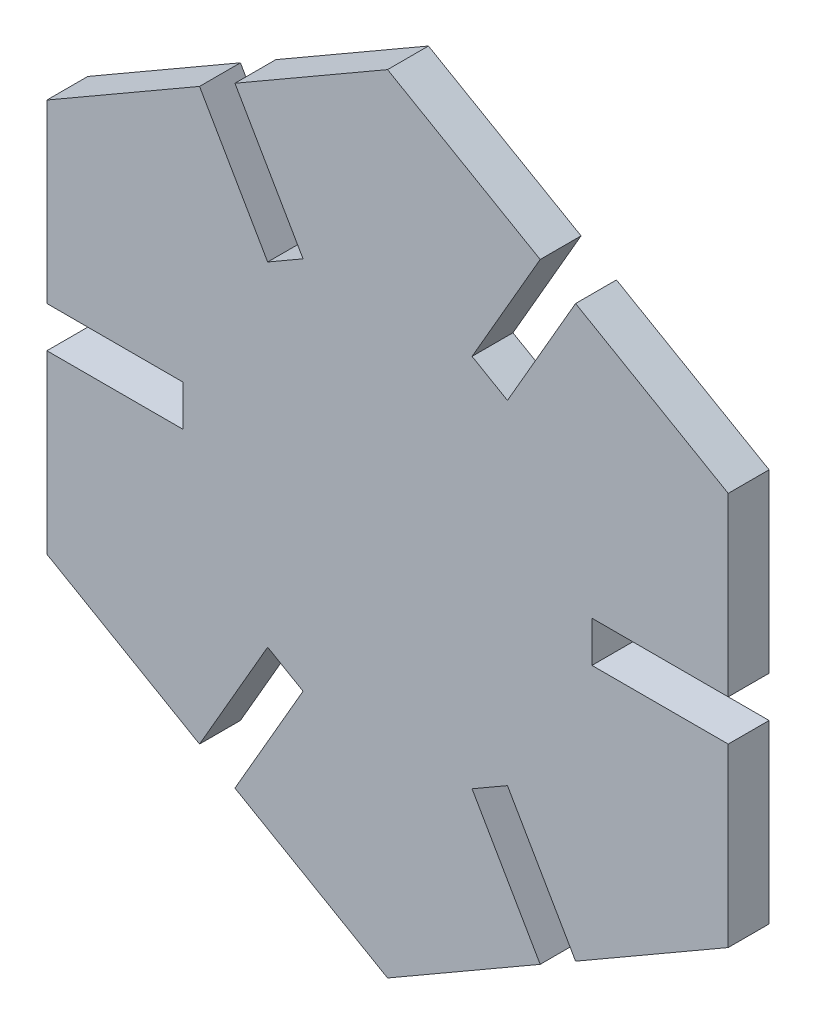
ISO-10303-21;
HEADER;
FILE_DESCRIPTION(('STEP AP214'),'2;1');
FILE_NAME('part.step','',(''),(''),'','','');
FILE_SCHEMA(('AUTOMOTIVE_DESIGN { 1 0 10303 214 1 1 1 1 }'));
ENDSEC;
DATA;
#1=APPLICATION_CONTEXT('core data for automotive mechanical design processes');
#2=APPLICATION_PROTOCOL_DEFINITION('international standard','automotive_design',2000,#1);
#3=PRODUCT_CONTEXT('',#1,'mechanical');
#4=PRODUCT('Part','Part','',(#3));
#5=PRODUCT_RELATED_PRODUCT_CATEGORY('part','',(#4));
#6=PRODUCT_DEFINITION_FORMATION('','',#4);
#7=PRODUCT_DEFINITION_CONTEXT('part definition',#1,'design');
#8=PRODUCT_DEFINITION('design','',#6,#7);
#9=PRODUCT_DEFINITION_SHAPE('','',#8);
#10=(LENGTH_UNIT() NAMED_UNIT(*) SI_UNIT(.MILLI.,.METRE.));
#11=(NAMED_UNIT(*) PLANE_ANGLE_UNIT() SI_UNIT($,.RADIAN.));
#12=(NAMED_UNIT(*) SI_UNIT($,.STERADIAN.) SOLID_ANGLE_UNIT());
#13=UNCERTAINTY_MEASURE_WITH_UNIT(LENGTH_MEASURE(1.E-05),#10,'distance_accuracy_value','');
#14=(GEOMETRIC_REPRESENTATION_CONTEXT(3) GLOBAL_UNCERTAINTY_ASSIGNED_CONTEXT((#13)) GLOBAL_UNIT_ASSIGNED_CONTEXT((#10,
#11,#12)) REPRESENTATION_CONTEXT('',''));
#15=CARTESIAN_POINT('',(0.,0.,0.));
#16=DIRECTION('',(0.,0.,1.));
#17=DIRECTION('',(1.,0.,0.));
#18=AXIS2_PLACEMENT_3D('',#15,#16,#17);
#19=CARTESIAN_POINT('',(-13.7990381056767,20.900635094611,3.));
#20=DIRECTION('',(0.866025403784439,0.5,0.));
#21=DIRECTION('',(-0.5,0.866025403784439,0.));
#22=AXIS2_PLACEMENT_3D('',#19,#20,#21);
#23=PLANE('',#22);
#24=DIRECTION('',(0.5,-0.866025403784439,0.));
#25=VECTOR('',#24,1.);
#26=CARTESIAN_POINT('',(-13.7990381056767,20.900635094611,0.));
#27=LINE('',#26,#25);
#28=CARTESIAN_POINT('',(-13.7990381056767,20.900635094611,0.));
#29=VERTEX_POINT('',#28);
#30=CARTESIAN_POINT('',(-8.79903810567667,12.2403810567666,0.));
#31=VERTEX_POINT('',#30);
#32=EDGE_CURVE('E263',#29,#31,#27,.T.);
#33=ORIENTED_EDGE('',*,*,#32,.F.);
#34=DIRECTION('',(0.,0.,-1.));
#35=VECTOR('',#34,1.);
#36=CARTESIAN_POINT('',(-13.7990381056767,20.900635094611,3.));
#37=LINE('',#36,#35);
#38=CARTESIAN_POINT('',(-13.7990381056767,20.900635094611,3.));
#39=VERTEX_POINT('',#38);
#40=EDGE_CURVE('E11',#39,#29,#37,.T.);
#41=ORIENTED_EDGE('',*,*,#40,.F.);
#42=DIRECTION('',(0.5,-0.866025403784439,0.));
#43=VECTOR('',#42,1.);
#44=CARTESIAN_POINT('',(-13.7990381056767,20.900635094611,3.));
#45=LINE('',#44,#43);
#46=CARTESIAN_POINT('',(-8.79903810567667,12.2403810567666,3.));
#47=VERTEX_POINT('',#46);
#48=EDGE_CURVE('E332',#39,#47,#45,.T.);
#49=ORIENTED_EDGE('',*,*,#48,.T.);
#50=DIRECTION('',(0.,0.,-1.));
#51=VECTOR('',#50,1.);
#52=CARTESIAN_POINT('',(-8.79903810567667,12.2403810567666,3.));
#53=LINE('',#52,#51);
#54=EDGE_CURVE('E36',#47,#31,#53,.T.);
#55=ORIENTED_EDGE('',*,*,#54,.T.);
#56=EDGE_LOOP('',(#33,#41,#49,#55));
#57=FACE_BOUND('',#56,.T.);
#58=ADVANCED_FACE('F33',(#57),#23,.T.);
#59=CARTESIAN_POINT('',(-13.7990381056767,20.900635094611,3.));
#60=DIRECTION('',(0.499999999999998,-0.86602540378444,0.));
#61=DIRECTION('',(0.86602540378444,0.499999999999998,0.));
#62=AXIS2_PLACEMENT_3D('',#59,#60,#61);
#63=PLANE('',#62);
#64=DIRECTION('',(-0.86602540378444,-0.499999999999998,0.));
#65=VECTOR('',#64,1.);
#66=CARTESIAN_POINT('',(-13.7990381056767,20.900635094611,0.));
#67=LINE('',#66,#65);
#68=CARTESIAN_POINT('',(-25.,14.4337567297407,0.));
#69=VERTEX_POINT('',#68);
#70=EDGE_CURVE('E144',#29,#69,#67,.T.);
#71=ORIENTED_EDGE('',*,*,#70,.T.);
#72=DIRECTION('',(0.,0.,-1.));
#73=VECTOR('',#72,1.);
#74=CARTESIAN_POINT('',(-25.,14.4337567297407,3.));
#75=LINE('',#74,#73);
#76=CARTESIAN_POINT('',(-25.,14.4337567297407,3.));
#77=VERTEX_POINT('',#76);
#78=EDGE_CURVE('E42',#77,#69,#75,.T.);
#79=ORIENTED_EDGE('',*,*,#78,.F.);
#80=DIRECTION('',(-0.86602540378444,-0.499999999999998,0.));
#81=VECTOR('',#80,1.);
#82=CARTESIAN_POINT('',(-13.7990381056767,20.900635094611,3.));
#83=LINE('',#82,#81);
#84=EDGE_CURVE('E241',#39,#77,#83,.T.);
#85=ORIENTED_EDGE('',*,*,#84,.F.);
#86=ORIENTED_EDGE('',*,*,#40,.T.);
#87=EDGE_LOOP('',(#71,#79,#85,#86));
#88=FACE_BOUND('',#87,.T.);
#89=ADVANCED_FACE('F584',(#88),#63,.F.);
#90=CARTESIAN_POINT('',(-25.,14.4337567297407,3.));
#91=DIRECTION('',(1.,0.,0.));
#92=DIRECTION('',(0.,1.,0.));
#93=AXIS2_PLACEMENT_3D('',#90,#91,#92);
#94=PLANE('',#93);
#95=DIRECTION('',(0.,-1.,0.));
#96=VECTOR('',#95,1.);
#97=CARTESIAN_POINT('',(-25.,14.4337567297407,0.));
#98=LINE('',#97,#96);
#99=CARTESIAN_POINT('',(-25.,1.5,0.));
#100=VERTEX_POINT('',#99);
#101=EDGE_CURVE('E248',#69,#100,#98,.T.);
#102=ORIENTED_EDGE('',*,*,#101,.T.);
#103=DIRECTION('',(0.,0.,-1.));
#104=VECTOR('',#103,1.);
#105=CARTESIAN_POINT('',(-25.,1.5,3.));
#106=LINE('',#105,#104);
#107=CARTESIAN_POINT('',(-25.,1.5,3.));
#108=VERTEX_POINT('',#107);
#109=EDGE_CURVE('E245',#108,#100,#106,.T.);
#110=ORIENTED_EDGE('',*,*,#109,.F.);
#111=DIRECTION('',(0.,-1.,0.));
#112=VECTOR('',#111,1.);
#113=CARTESIAN_POINT('',(-25.,14.4337567297407,3.));
#114=LINE('',#113,#112);
#115=EDGE_CURVE('E234',#77,#108,#114,.T.);
#116=ORIENTED_EDGE('',*,*,#115,.F.);
#117=ORIENTED_EDGE('',*,*,#78,.T.);
#118=EDGE_LOOP('',(#102,#110,#116,#117));
#119=FACE_BOUND('',#118,.T.);
#120=ADVANCED_FACE('F246',(#119),#94,.F.);
#121=CARTESIAN_POINT('',(-25.,1.5,3.));
#122=DIRECTION('',(0.,1.,0.));
#123=DIRECTION('',(-1.,0.,0.));
#124=AXIS2_PLACEMENT_3D('',#121,#122,#123);
#125=PLANE('',#124);
#126=DIRECTION('',(1.,0.,0.));
#127=VECTOR('',#126,1.);
#128=CARTESIAN_POINT('',(-25.,1.5,0.));
#129=LINE('',#128,#127);
#130=CARTESIAN_POINT('',(-15.,1.5,0.));
#131=VERTEX_POINT('',#130);
#132=EDGE_CURVE('E329',#100,#131,#129,.T.);
#133=ORIENTED_EDGE('',*,*,#132,.T.);
#134=DIRECTION('',(0.,0.,-1.));
#135=VECTOR('',#134,1.);
#136=CARTESIAN_POINT('',(-15.,1.5,3.));
#137=LINE('',#136,#135);
#138=CARTESIAN_POINT('',(-15.,1.5,3.));
#139=VERTEX_POINT('',#138);
#140=EDGE_CURVE('E251',#139,#131,#137,.T.);
#141=ORIENTED_EDGE('',*,*,#140,.F.);
#142=DIRECTION('',(1.,0.,0.));
#143=VECTOR('',#142,1.);
#144=CARTESIAN_POINT('',(-25.,1.5,3.));
#145=LINE('',#144,#143);
#146=EDGE_CURVE('E239',#108,#139,#145,.T.);
#147=ORIENTED_EDGE('',*,*,#146,.F.);
#148=ORIENTED_EDGE('',*,*,#109,.T.);
#149=EDGE_LOOP('',(#133,#141,#147,#148));
#150=FACE_BOUND('',#149,.T.);
#151=ADVANCED_FACE('F253',(#150),#125,.F.);
#152=CARTESIAN_POINT('',(-15.,1.5,3.));
#153=DIRECTION('',(1.,0.,0.));
#154=DIRECTION('',(0.,1.,0.));
#155=AXIS2_PLACEMENT_3D('',#152,#153,#154);
#156=PLANE('',#155);
#157=DIRECTION('',(0.,-1.,0.));
#158=VECTOR('',#157,1.);
#159=CARTESIAN_POINT('',(-15.,1.5,0.));
#160=LINE('',#159,#158);
#161=CARTESIAN_POINT('',(-15.,-1.5,0.));
#162=VERTEX_POINT('',#161);
#163=EDGE_CURVE('E327',#131,#162,#160,.T.);
#164=ORIENTED_EDGE('',*,*,#163,.T.);
#165=DIRECTION('',(0.,0.,-1.));
#166=VECTOR('',#165,1.);
#167=CARTESIAN_POINT('',(-15.,-1.5,3.));
#168=LINE('',#167,#166);
#169=CARTESIAN_POINT('',(-15.,-1.5,3.));
#170=VERTEX_POINT('',#169);
#171=EDGE_CURVE('E336',#170,#162,#168,.T.);
#172=ORIENTED_EDGE('',*,*,#171,.F.);
#173=DIRECTION('',(0.,-1.,0.));
#174=VECTOR('',#173,1.);
#175=CARTESIAN_POINT('',(-15.,1.5,3.));
#176=LINE('',#175,#174);
#177=EDGE_CURVE('E256',#139,#170,#176,.T.);
#178=ORIENTED_EDGE('',*,*,#177,.F.);
#179=ORIENTED_EDGE('',*,*,#140,.T.);
#180=EDGE_LOOP('',(#164,#172,#178,#179));
#181=FACE_BOUND('',#180,.T.);
#182=ADVANCED_FACE('F406',(#181),#156,.F.);
#183=CARTESIAN_POINT('',(-15.,-1.5,3.));
#184=DIRECTION('',(0.,-1.,0.));
#185=DIRECTION('',(1.,0.,0.));
#186=AXIS2_PLACEMENT_3D('',#183,#184,#185);
#187=PLANE('',#186);
#188=DIRECTION('',(-1.,0.,0.));
#189=VECTOR('',#188,1.);
#190=CARTESIAN_POINT('',(-15.,-1.5,0.));
#191=LINE('',#190,#189);
#192=CARTESIAN_POINT('',(-25.,-1.5,0.));
#193=VERTEX_POINT('',#192);
#194=EDGE_CURVE('E325',#162,#193,#191,.T.);
#195=ORIENTED_EDGE('',*,*,#194,.T.);
#196=DIRECTION('',(0.,0.,-1.));
#197=VECTOR('',#196,1.);
#198=CARTESIAN_POINT('',(-25.,-1.5,3.));
#199=LINE('',#198,#197);
#200=CARTESIAN_POINT('',(-25.,-1.5,3.));
#201=VERTEX_POINT('',#200);
#202=EDGE_CURVE('E339',#201,#193,#199,.T.);
#203=ORIENTED_EDGE('',*,*,#202,.F.);
#204=DIRECTION('',(-1.,0.,0.));
#205=VECTOR('',#204,1.);
#206=CARTESIAN_POINT('',(-15.,-1.5,3.));
#207=LINE('',#206,#205);
#208=EDGE_CURVE('E258',#170,#201,#207,.T.);
#209=ORIENTED_EDGE('',*,*,#208,.F.);
#210=ORIENTED_EDGE('',*,*,#171,.T.);
#211=EDGE_LOOP('',(#195,#203,#209,#210));
#212=FACE_BOUND('',#211,.T.);
#213=ADVANCED_FACE('F414',(#212),#187,.F.);
#214=CARTESIAN_POINT('',(-25.,-1.5,3.));
#215=DIRECTION('',(1.,0.,0.));
#216=DIRECTION('',(0.,1.,0.));
#217=AXIS2_PLACEMENT_3D('',#214,#215,#216);
#218=PLANE('',#217);
#219=DIRECTION('',(0.,-1.,0.));
#220=VECTOR('',#219,1.);
#221=CARTESIAN_POINT('',(-25.,-1.5,0.));
#222=LINE('',#221,#220);
#223=CARTESIAN_POINT('',(-25.,-14.4337567297406,0.));
#224=VERTEX_POINT('',#223);
#225=EDGE_CURVE('E323',#193,#224,#222,.T.);
#226=ORIENTED_EDGE('',*,*,#225,.T.);
#227=DIRECTION('',(0.,0.,-1.));
#228=VECTOR('',#227,1.);
#229=CARTESIAN_POINT('',(-25.,-14.4337567297406,3.));
#230=LINE('',#229,#228);
#231=CARTESIAN_POINT('',(-25.,-14.4337567297406,3.));
#232=VERTEX_POINT('',#231);
#233=EDGE_CURVE('E342',#232,#224,#230,.T.);
#234=ORIENTED_EDGE('',*,*,#233,.F.);
#235=DIRECTION('',(0.,-1.,0.));
#236=VECTOR('',#235,1.);
#237=CARTESIAN_POINT('',(-25.,-1.5,3.));
#238=LINE('',#237,#236);
#239=EDGE_CURVE('E411',#201,#232,#238,.T.);
#240=ORIENTED_EDGE('',*,*,#239,.F.);
#241=ORIENTED_EDGE('',*,*,#202,.T.);
#242=EDGE_LOOP('',(#226,#234,#240,#241));
#243=FACE_BOUND('',#242,.T.);
#244=ADVANCED_FACE('F417',(#243),#218,.F.);
#245=CARTESIAN_POINT('',(-25.,-14.4337567297406,3.));
#246=DIRECTION('',(0.5,0.866025403784438,0.));
#247=DIRECTION('',(-0.866025403784439,0.5,0.));
#248=AXIS2_PLACEMENT_3D('',#245,#246,#247);
#249=PLANE('',#248);
#250=DIRECTION('',(0.866025403784439,-0.5,0.));
#251=VECTOR('',#250,1.);
#252=CARTESIAN_POINT('',(-25.,-14.4337567297406,0.));
#253=LINE('',#252,#251);
#254=CARTESIAN_POINT('',(-13.7990381056767,-20.900635094611,0.));
#255=VERTEX_POINT('',#254);
#256=EDGE_CURVE('E321',#224,#255,#253,.T.);
#257=ORIENTED_EDGE('',*,*,#256,.T.);
#258=DIRECTION('',(0.,0.,-1.));
#259=VECTOR('',#258,1.);
#260=CARTESIAN_POINT('',(-13.7990381056767,-20.900635094611,3.));
#261=LINE('',#260,#259);
#262=CARTESIAN_POINT('',(-13.7990381056767,-20.900635094611,3.));
#263=VERTEX_POINT('',#262);
#264=EDGE_CURVE('E345',#263,#255,#261,.T.);
#265=ORIENTED_EDGE('',*,*,#264,.F.);
#266=DIRECTION('',(0.866025403784439,-0.5,0.));
#267=VECTOR('',#266,1.);
#268=CARTESIAN_POINT('',(-25.,-14.4337567297406,3.));
#269=LINE('',#268,#267);
#270=EDGE_CURVE('E419',#232,#263,#269,.T.);
#271=ORIENTED_EDGE('',*,*,#270,.F.);
#272=ORIENTED_EDGE('',*,*,#233,.T.);
#273=EDGE_LOOP('',(#257,#265,#271,#272));
#274=FACE_BOUND('',#273,.T.);
#275=ADVANCED_FACE('F573',(#274),#249,.F.);
#276=CARTESIAN_POINT('',(-13.7990381056767,-20.900635094611,3.));
#277=DIRECTION('',(-0.866025403784439,0.5,0.));
#278=DIRECTION('',(-0.5,-0.866025403784439,0.));
#279=AXIS2_PLACEMENT_3D('',#276,#277,#278);
#280=PLANE('',#279);
#281=DIRECTION('',(0.5,0.866025403784439,0.));
#282=VECTOR('',#281,1.);
#283=CARTESIAN_POINT('',(-13.7990381056767,-20.900635094611,0.));
#284=LINE('',#283,#282);
#285=CARTESIAN_POINT('',(-8.79903810567667,-12.2403810567666,0.));
#286=VERTEX_POINT('',#285);
#287=EDGE_CURVE('E319',#255,#286,#284,.T.);
#288=ORIENTED_EDGE('',*,*,#287,.T.);
#289=DIRECTION('',(0.,0.,-1.));
#290=VECTOR('',#289,1.);
#291=CARTESIAN_POINT('',(-8.79903810567667,-12.2403810567666,3.));
#292=LINE('',#291,#290);
#293=CARTESIAN_POINT('',(-8.79903810567667,-12.2403810567666,3.));
#294=VERTEX_POINT('',#293);
#295=EDGE_CURVE('E348',#294,#286,#292,.T.);
#296=ORIENTED_EDGE('',*,*,#295,.F.);
#297=DIRECTION('',(0.5,0.866025403784439,0.));
#298=VECTOR('',#297,1.);
#299=CARTESIAN_POINT('',(-13.7990381056767,-20.900635094611,3.));
#300=LINE('',#299,#298);
#301=EDGE_CURVE('E421',#263,#294,#300,.T.);
#302=ORIENTED_EDGE('',*,*,#301,.F.);
#303=ORIENTED_EDGE('',*,*,#264,.T.);
#304=EDGE_LOOP('',(#288,#296,#302,#303));
#305=FACE_BOUND('',#304,.T.);
#306=ADVANCED_FACE('F570',(#305),#280,.F.);
#307=CARTESIAN_POINT('',(-8.79903810567667,-12.2403810567666,3.));
#308=DIRECTION('',(0.499999999999996,0.866025403784441,0.));
#309=DIRECTION('',(-0.866025403784441,0.499999999999996,0.));
#310=AXIS2_PLACEMENT_3D('',#307,#308,#309);
#311=PLANE('',#310);
#312=DIRECTION('',(0.866025403784441,-0.499999999999996,0.));
#313=VECTOR('',#312,1.);
#314=CARTESIAN_POINT('',(-8.79903810567667,-12.2403810567666,0.));
#315=LINE('',#314,#313);
#316=CARTESIAN_POINT('',(-6.20096189432334,-13.7403810567666,0.));
#317=VERTEX_POINT('',#316);
#318=EDGE_CURVE('E317',#286,#317,#315,.T.);
#319=ORIENTED_EDGE('',*,*,#318,.T.);
#320=DIRECTION('',(0.,0.,-1.));
#321=VECTOR('',#320,1.);
#322=CARTESIAN_POINT('',(-6.20096189432334,-13.7403810567666,3.));
#323=LINE('',#322,#321);
#324=CARTESIAN_POINT('',(-6.20096189432334,-13.7403810567666,3.));
#325=VERTEX_POINT('',#324);
#326=EDGE_CURVE('E351',#325,#317,#323,.T.);
#327=ORIENTED_EDGE('',*,*,#326,.F.);
#328=DIRECTION('',(0.866025403784441,-0.499999999999996,0.));
#329=VECTOR('',#328,1.);
#330=CARTESIAN_POINT('',(-8.79903810567667,-12.2403810567666,3.));
#331=LINE('',#330,#329);
#332=EDGE_CURVE('E425',#294,#325,#331,.T.);
#333=ORIENTED_EDGE('',*,*,#332,.F.);
#334=ORIENTED_EDGE('',*,*,#295,.T.);
#335=EDGE_LOOP('',(#319,#327,#333,#334));
#336=FACE_BOUND('',#335,.T.);
#337=ADVANCED_FACE('F565',(#336),#311,.F.);
#338=CARTESIAN_POINT('',(-6.20096189432334,-13.7403810567666,3.));
#339=DIRECTION('',(0.866025403784439,-0.5,0.));
#340=DIRECTION('',(0.5,0.866025403784439,0.));
#341=AXIS2_PLACEMENT_3D('',#338,#339,#340);
#342=PLANE('',#341);
#343=DIRECTION('',(-0.499999999999999,-0.866025403784439,0.));
#344=VECTOR('',#343,1.);
#345=CARTESIAN_POINT('',(-6.20096189432334,-13.7403810567666,0.));
#346=LINE('',#345,#344);
#347=CARTESIAN_POINT('',(-11.2009618943233,-22.400635094611,0.));
#348=VERTEX_POINT('',#347);
#349=EDGE_CURVE('E315',#317,#348,#346,.T.);
#350=ORIENTED_EDGE('',*,*,#349,.T.);
#351=DIRECTION('',(0.,0.,-1.));
#352=VECTOR('',#351,1.);
#353=CARTESIAN_POINT('',(-11.2009618943233,-22.400635094611,3.));
#354=LINE('',#353,#352);
#355=CARTESIAN_POINT('',(-11.2009618943233,-22.400635094611,3.));
#356=VERTEX_POINT('',#355);
#357=EDGE_CURVE('E354',#356,#348,#354,.T.);
#358=ORIENTED_EDGE('',*,*,#357,.F.);
#359=DIRECTION('',(-0.499999999999999,-0.866025403784439,0.));
#360=VECTOR('',#359,1.);
#361=CARTESIAN_POINT('',(-6.20096189432334,-13.7403810567666,3.));
#362=LINE('',#361,#360);
#363=EDGE_CURVE('E427',#325,#356,#362,.T.);
#364=ORIENTED_EDGE('',*,*,#363,.F.);
#365=ORIENTED_EDGE('',*,*,#326,.T.);
#366=EDGE_LOOP('',(#350,#358,#364,#365));
#367=FACE_BOUND('',#366,.T.);
#368=ADVANCED_FACE('F559',(#367),#342,.F.);
#369=CARTESIAN_POINT('',(-11.2009618943233,-22.400635094611,3.));
#370=DIRECTION('',(0.500000000000001,0.866025403784438,0.));
#371=DIRECTION('',(-0.866025403784438,0.500000000000001,0.));
#372=AXIS2_PLACEMENT_3D('',#369,#370,#371);
#373=PLANE('',#372);
#374=DIRECTION('',(0.866025403784438,-0.500000000000001,0.));
#375=VECTOR('',#374,1.);
#376=CARTESIAN_POINT('',(-11.2009618943233,-22.400635094611,0.));
#377=LINE('',#376,#375);
#378=CARTESIAN_POINT('',(0.,-28.8675134594813,0.));
#379=VERTEX_POINT('',#378);
#380=EDGE_CURVE('E313',#348,#379,#377,.T.);
#381=ORIENTED_EDGE('',*,*,#380,.T.);
#382=DIRECTION('',(0.,0.,-1.));
#383=VECTOR('',#382,1.);
#384=CARTESIAN_POINT('',(0.,-28.8675134594813,3.));
#385=LINE('',#384,#383);
#386=CARTESIAN_POINT('',(0.,-28.8675134594813,3.));
#387=VERTEX_POINT('',#386);
#388=EDGE_CURVE('E357',#387,#379,#385,.T.);
#389=ORIENTED_EDGE('',*,*,#388,.F.);
#390=DIRECTION('',(0.866025403784438,-0.500000000000001,0.));
#391=VECTOR('',#390,1.);
#392=CARTESIAN_POINT('',(-11.2009618943233,-22.400635094611,3.));
#393=LINE('',#392,#391);
#394=EDGE_CURVE('E429',#356,#387,#393,.T.);
#395=ORIENTED_EDGE('',*,*,#394,.F.);
#396=ORIENTED_EDGE('',*,*,#357,.T.);
#397=EDGE_LOOP('',(#381,#389,#395,#396));
#398=FACE_BOUND('',#397,.T.);
#399=ADVANCED_FACE('F555',(#398),#373,.F.);
#400=CARTESIAN_POINT('',(0.,-28.8675134594813,3.));
#401=DIRECTION('',(-0.499999999999999,0.866025403784439,0.));
#402=DIRECTION('',(-0.866025403784439,-0.499999999999999,0.));
#403=AXIS2_PLACEMENT_3D('',#400,#401,#402);
#404=PLANE('',#403);
#405=DIRECTION('',(0.866025403784439,0.499999999999999,0.));
#406=VECTOR('',#405,1.);
#407=CARTESIAN_POINT('',(0.,-28.8675134594813,0.));
#408=LINE('',#407,#406);
#409=CARTESIAN_POINT('',(11.2009618943233,-22.400635094611,0.));
#410=VERTEX_POINT('',#409);
#411=EDGE_CURVE('E311',#379,#410,#408,.T.);
#412=ORIENTED_EDGE('',*,*,#411,.T.);
#413=DIRECTION('',(0.,0.,-1.));
#414=VECTOR('',#413,1.);
#415=CARTESIAN_POINT('',(11.2009618943233,-22.400635094611,3.));
#416=LINE('',#415,#414);
#417=CARTESIAN_POINT('',(11.2009618943233,-22.400635094611,3.));
#418=VERTEX_POINT('',#417);
#419=EDGE_CURVE('E360',#418,#410,#416,.T.);
#420=ORIENTED_EDGE('',*,*,#419,.F.);
#421=DIRECTION('',(0.866025403784439,0.499999999999999,0.));
#422=VECTOR('',#421,1.);
#423=CARTESIAN_POINT('',(0.,-28.8675134594813,3.));
#424=LINE('',#423,#422);
#425=EDGE_CURVE('E431',#387,#418,#424,.T.);
#426=ORIENTED_EDGE('',*,*,#425,.F.);
#427=ORIENTED_EDGE('',*,*,#388,.T.);
#428=EDGE_LOOP('',(#412,#420,#426,#427));
#429=FACE_BOUND('',#428,.T.);
#430=ADVANCED_FACE('F550',(#429),#404,.F.);
#431=CARTESIAN_POINT('',(11.2009618943233,-22.400635094611,3.));
#432=DIRECTION('',(-0.866025403784439,-0.5,0.));
#433=DIRECTION('',(0.5,-0.866025403784439,0.));
#434=AXIS2_PLACEMENT_3D('',#431,#432,#433);
#435=PLANE('',#434);
#436=DIRECTION('',(-0.5,0.866025403784439,0.));
#437=VECTOR('',#436,1.);
#438=CARTESIAN_POINT('',(11.2009618943233,-22.400635094611,0.));
#439=LINE('',#438,#437);
#440=CARTESIAN_POINT('',(6.20096189432335,-13.7403810567666,0.));
#441=VERTEX_POINT('',#440);
#442=EDGE_CURVE('E309',#410,#441,#439,.T.);
#443=ORIENTED_EDGE('',*,*,#442,.T.);
#444=DIRECTION('',(0.,0.,-1.));
#445=VECTOR('',#444,1.);
#446=CARTESIAN_POINT('',(6.20096189432335,-13.7403810567666,3.));
#447=LINE('',#446,#445);
#448=CARTESIAN_POINT('',(6.20096189432335,-13.7403810567666,3.));
#449=VERTEX_POINT('',#448);
#450=EDGE_CURVE('E363',#449,#441,#447,.T.);
#451=ORIENTED_EDGE('',*,*,#450,.F.);
#452=DIRECTION('',(-0.5,0.866025403784439,0.));
#453=VECTOR('',#452,1.);
#454=CARTESIAN_POINT('',(11.2009618943233,-22.400635094611,3.));
#455=LINE('',#454,#453);
#456=EDGE_CURVE('E433',#418,#449,#455,.T.);
#457=ORIENTED_EDGE('',*,*,#456,.F.);
#458=ORIENTED_EDGE('',*,*,#419,.T.);
#459=EDGE_LOOP('',(#443,#451,#457,#458));
#460=FACE_BOUND('',#459,.T.);
#461=ADVANCED_FACE('F544',(#460),#435,.F.);
#462=CARTESIAN_POINT('',(6.20096189432335,-13.7403810567666,3.));
#463=DIRECTION('',(-0.5,0.866025403784439,0.));
#464=DIRECTION('',(-0.866025403784439,-0.5,0.));
#465=AXIS2_PLACEMENT_3D('',#462,#463,#464);
#466=PLANE('',#465);
#467=DIRECTION('',(0.866025403784439,0.5,0.));
#468=VECTOR('',#467,1.);
#469=CARTESIAN_POINT('',(6.20096189432335,-13.7403810567666,0.));
#470=LINE('',#469,#468);
#471=CARTESIAN_POINT('',(8.79903810567667,-12.2403810567666,0.));
#472=VERTEX_POINT('',#471);
#473=EDGE_CURVE('E307',#441,#472,#470,.T.);
#474=ORIENTED_EDGE('',*,*,#473,.T.);
#475=DIRECTION('',(0.,0.,-1.));
#476=VECTOR('',#475,1.);
#477=CARTESIAN_POINT('',(8.79903810567667,-12.2403810567666,3.));
#478=LINE('',#477,#476);
#479=CARTESIAN_POINT('',(8.79903810567667,-12.2403810567666,3.));
#480=VERTEX_POINT('',#479);
#481=EDGE_CURVE('E366',#480,#472,#478,.T.);
#482=ORIENTED_EDGE('',*,*,#481,.F.);
#483=DIRECTION('',(0.866025403784439,0.5,0.));
#484=VECTOR('',#483,1.);
#485=CARTESIAN_POINT('',(6.20096189432335,-13.7403810567666,3.));
#486=LINE('',#485,#484);
#487=EDGE_CURVE('E435',#449,#480,#486,.T.);
#488=ORIENTED_EDGE('',*,*,#487,.F.);
#489=ORIENTED_EDGE('',*,*,#450,.T.);
#490=EDGE_LOOP('',(#474,#482,#488,#489));
#491=FACE_BOUND('',#490,.T.);
#492=ADVANCED_FACE('F540',(#491),#466,.F.);
#493=CARTESIAN_POINT('',(8.79903810567667,-12.2403810567666,3.));
#494=DIRECTION('',(0.866025403784439,0.5,0.));
#495=DIRECTION('',(-0.5,0.866025403784439,0.));
#496=AXIS2_PLACEMENT_3D('',#493,#494,#495);
#497=PLANE('',#496);
#498=DIRECTION('',(0.5,-0.866025403784439,0.));
#499=VECTOR('',#498,1.);
#500=CARTESIAN_POINT('',(8.79903810567667,-12.2403810567666,0.));
#501=LINE('',#500,#499);
#502=CARTESIAN_POINT('',(13.7990381056767,-20.900635094611,0.));
#503=VERTEX_POINT('',#502);
#504=EDGE_CURVE('E305',#472,#503,#501,.T.);
#505=ORIENTED_EDGE('',*,*,#504,.T.);
#506=DIRECTION('',(0.,0.,-1.));
#507=VECTOR('',#506,1.);
#508=CARTESIAN_POINT('',(13.7990381056767,-20.900635094611,3.));
#509=LINE('',#508,#507);
#510=CARTESIAN_POINT('',(13.7990381056767,-20.900635094611,3.));
#511=VERTEX_POINT('',#510);
#512=EDGE_CURVE('E369',#511,#503,#509,.T.);
#513=ORIENTED_EDGE('',*,*,#512,.F.);
#514=DIRECTION('',(0.5,-0.866025403784439,0.));
#515=VECTOR('',#514,1.);
#516=CARTESIAN_POINT('',(8.79903810567667,-12.2403810567666,3.));
#517=LINE('',#516,#515);
#518=EDGE_CURVE('E437',#480,#511,#517,.T.);
#519=ORIENTED_EDGE('',*,*,#518,.F.);
#520=ORIENTED_EDGE('',*,*,#481,.T.);
#521=EDGE_LOOP('',(#505,#513,#519,#520));
#522=FACE_BOUND('',#521,.T.);
#523=ADVANCED_FACE('F535',(#522),#497,.F.);
#524=CARTESIAN_POINT('',(13.7990381056767,-20.900635094611,3.));
#525=DIRECTION('',(-0.5,0.866025403784439,0.));
#526=DIRECTION('',(-0.866025403784439,-0.5,0.));
#527=AXIS2_PLACEMENT_3D('',#524,#525,#526);
#528=PLANE('',#527);
#529=DIRECTION('',(0.866025403784439,0.5,0.));
#530=VECTOR('',#529,1.);
#531=CARTESIAN_POINT('',(13.7990381056767,-20.900635094611,0.));
#532=LINE('',#531,#530);
#533=CARTESIAN_POINT('',(25.,-14.4337567297407,0.));
#534=VERTEX_POINT('',#533);
#535=EDGE_CURVE('E303',#503,#534,#532,.T.);
#536=ORIENTED_EDGE('',*,*,#535,.T.);
#537=DIRECTION('',(0.,0.,-1.));
#538=VECTOR('',#537,1.);
#539=CARTESIAN_POINT('',(25.,-14.4337567297407,3.));
#540=LINE('',#539,#538);
#541=CARTESIAN_POINT('',(25.,-14.4337567297407,3.));
#542=VERTEX_POINT('',#541);
#543=EDGE_CURVE('E372',#542,#534,#540,.T.);
#544=ORIENTED_EDGE('',*,*,#543,.F.);
#545=DIRECTION('',(0.866025403784439,0.5,0.));
#546=VECTOR('',#545,1.);
#547=CARTESIAN_POINT('',(13.7990381056767,-20.900635094611,3.));
#548=LINE('',#547,#546);
#549=EDGE_CURVE('E439',#511,#542,#548,.T.);
#550=ORIENTED_EDGE('',*,*,#549,.F.);
#551=ORIENTED_EDGE('',*,*,#512,.T.);
#552=EDGE_LOOP('',(#536,#544,#550,#551));
#553=FACE_BOUND('',#552,.T.);
#554=ADVANCED_FACE('F529',(#553),#528,.F.);
#555=CARTESIAN_POINT('',(25.,-14.4337567297407,3.));
#556=DIRECTION('',(-1.,0.,0.));
#557=DIRECTION('',(0.,-1.,0.));
#558=AXIS2_PLACEMENT_3D('',#555,#556,#557);
#559=PLANE('',#558);
#560=DIRECTION('',(0.,1.,0.));
#561=VECTOR('',#560,1.);
#562=CARTESIAN_POINT('',(25.,-14.4337567297407,0.));
#563=LINE('',#562,#561);
#564=CARTESIAN_POINT('',(25.,-1.49999999999999,0.));
#565=VERTEX_POINT('',#564);
#566=EDGE_CURVE('E300',#534,#565,#563,.T.);
#567=ORIENTED_EDGE('',*,*,#566,.T.);
#568=DIRECTION('',(0.,0.,-1.));
#569=VECTOR('',#568,1.);
#570=CARTESIAN_POINT('',(25.,-1.49999999999999,3.));
#571=LINE('',#570,#569);
#572=CARTESIAN_POINT('',(25.,-1.49999999999999,3.));
#573=VERTEX_POINT('',#572);
#574=EDGE_CURVE('E375',#573,#565,#571,.T.);
#575=ORIENTED_EDGE('',*,*,#574,.F.);
#576=DIRECTION('',(0.,1.,0.));
#577=VECTOR('',#576,1.);
#578=CARTESIAN_POINT('',(25.,-14.4337567297407,3.));
#579=LINE('',#578,#577);
#580=EDGE_CURVE('E441',#542,#573,#579,.T.);
#581=ORIENTED_EDGE('',*,*,#580,.F.);
#582=ORIENTED_EDGE('',*,*,#543,.T.);
#583=EDGE_LOOP('',(#567,#575,#581,#582));
#584=FACE_BOUND('',#583,.T.);
#585=ADVANCED_FACE('F525',(#584),#559,.F.);
#586=CARTESIAN_POINT('',(15.,-1.49999999999999,3.));
#587=DIRECTION('',(0.,1.,0.));
#588=DIRECTION('',(-1.,0.,0.));
#589=AXIS2_PLACEMENT_3D('',#586,#587,#588);
#590=PLANE('',#589);
#591=DIRECTION('',(1.,0.,0.));
#592=VECTOR('',#591,1.);
#593=CARTESIAN_POINT('',(15.,-1.49999999999999,0.));
#594=LINE('',#593,#592);
#595=CARTESIAN_POINT('',(15.,-1.49999999999999,0.));
#596=VERTEX_POINT('',#595);
#597=EDGE_CURVE('E297',#596,#565,#594,.T.);
#598=ORIENTED_EDGE('',*,*,#597,.F.);
#599=DIRECTION('',(0.,0.,-1.));
#600=VECTOR('',#599,1.);
#601=CARTESIAN_POINT('',(15.,-1.49999999999999,3.));
#602=LINE('',#601,#600);
#603=CARTESIAN_POINT('',(15.,-1.49999999999999,3.));
#604=VERTEX_POINT('',#603);
#605=EDGE_CURVE('E377',#604,#596,#602,.T.);
#606=ORIENTED_EDGE('',*,*,#605,.F.);
#607=DIRECTION('',(1.,0.,0.));
#608=VECTOR('',#607,1.);
#609=CARTESIAN_POINT('',(15.,-1.49999999999999,3.));
#610=LINE('',#609,#608);
#611=EDGE_CURVE('E443',#604,#573,#610,.T.);
#612=ORIENTED_EDGE('',*,*,#611,.T.);
#613=ORIENTED_EDGE('',*,*,#574,.T.);
#614=EDGE_LOOP('',(#598,#606,#612,#613));
#615=FACE_BOUND('',#614,.T.);
#616=ADVANCED_FACE('F520',(#615),#590,.T.);
#617=CARTESIAN_POINT('',(15.,1.50000000000002,3.));
#618=DIRECTION('',(1.,0.,0.));
#619=DIRECTION('',(0.,0.,-1.));
#620=AXIS2_PLACEMENT_3D('',#617,#618,#619);
#621=PLANE('',#620);
#622=DIRECTION('',(0.,-1.,0.));
#623=VECTOR('',#622,1.);
#624=CARTESIAN_POINT('',(15.,1.50000000000002,0.));
#625=LINE('',#624,#623);
#626=CARTESIAN_POINT('',(15.,1.50000000000002,0.));
#627=VERTEX_POINT('',#626);
#628=EDGE_CURVE('E294',#627,#596,#625,.T.);
#629=ORIENTED_EDGE('',*,*,#628,.F.);
#630=DIRECTION('',(0.,0.,-1.));
#631=VECTOR('',#630,1.);
#632=CARTESIAN_POINT('',(15.,1.50000000000002,3.));
#633=LINE('',#632,#631);
#634=CARTESIAN_POINT('',(15.,1.50000000000002,3.));
#635=VERTEX_POINT('',#634);
#636=EDGE_CURVE('E379',#635,#627,#633,.T.);
#637=ORIENTED_EDGE('',*,*,#636,.F.);
#638=DIRECTION('',(0.,-1.,0.));
#639=VECTOR('',#638,1.);
#640=CARTESIAN_POINT('',(15.,1.50000000000002,3.));
#641=LINE('',#640,#639);
#642=EDGE_CURVE('E446',#635,#604,#641,.T.);
#643=ORIENTED_EDGE('',*,*,#642,.T.);
#644=ORIENTED_EDGE('',*,*,#605,.T.);
#645=EDGE_LOOP('',(#629,#637,#643,#644));
#646=FACE_BOUND('',#645,.T.);
#647=ADVANCED_FACE('F515',(#646),#621,.T.);
#648=CARTESIAN_POINT('',(25.,1.50000000000002,3.));
#649=DIRECTION('',(0.,-1.,0.));
#650=DIRECTION('',(1.,0.,0.));
#651=AXIS2_PLACEMENT_3D('',#648,#649,#650);
#652=PLANE('',#651);
#653=DIRECTION('',(-1.,0.,0.));
#654=VECTOR('',#653,1.);
#655=CARTESIAN_POINT('',(25.,1.50000000000002,0.));
#656=LINE('',#655,#654);
#657=CARTESIAN_POINT('',(25.,1.50000000000002,0.));
#658=VERTEX_POINT('',#657);
#659=EDGE_CURVE('E291',#658,#627,#656,.T.);
#660=ORIENTED_EDGE('',*,*,#659,.F.);
#661=DIRECTION('',(0.,0.,-1.));
#662=VECTOR('',#661,1.);
#663=CARTESIAN_POINT('',(25.,1.50000000000002,3.));
#664=LINE('',#663,#662);
#665=CARTESIAN_POINT('',(25.,1.50000000000002,3.));
#666=VERTEX_POINT('',#665);
#667=EDGE_CURVE('E381',#666,#658,#664,.T.);
#668=ORIENTED_EDGE('',*,*,#667,.F.);
#669=DIRECTION('',(-1.,0.,0.));
#670=VECTOR('',#669,1.);
#671=CARTESIAN_POINT('',(25.,1.50000000000002,3.));
#672=LINE('',#671,#670);
#673=EDGE_CURVE('E449',#666,#635,#672,.T.);
#674=ORIENTED_EDGE('',*,*,#673,.T.);
#675=ORIENTED_EDGE('',*,*,#636,.T.);
#676=EDGE_LOOP('',(#660,#668,#674,#675));
#677=FACE_BOUND('',#676,.T.);
#678=ADVANCED_FACE('F509',(#677),#652,.T.);
#679=CARTESIAN_POINT('',(25.,1.50000000000002,3.));
#680=DIRECTION('',(-1.,0.,0.));
#681=DIRECTION('',(0.,-1.,0.));
#682=AXIS2_PLACEMENT_3D('',#679,#680,#681);
#683=PLANE('',#682);
#684=DIRECTION('',(0.,1.,0.));
#685=VECTOR('',#684,1.);
#686=CARTESIAN_POINT('',(25.,1.50000000000002,0.));
#687=LINE('',#686,#685);
#688=CARTESIAN_POINT('',(25.,14.4337567297406,0.));
#689=VERTEX_POINT('',#688);
#690=EDGE_CURVE('E289',#658,#689,#687,.T.);
#691=ORIENTED_EDGE('',*,*,#690,.T.);
#692=DIRECTION('',(0.,0.,-1.));
#693=VECTOR('',#692,1.);
#694=CARTESIAN_POINT('',(25.,14.4337567297406,3.));
#695=LINE('',#694,#693);
#696=CARTESIAN_POINT('',(25.,14.4337567297406,3.));
#697=VERTEX_POINT('',#696);
#698=EDGE_CURVE('E383',#697,#689,#695,.T.);
#699=ORIENTED_EDGE('',*,*,#698,.F.);
#700=DIRECTION('',(0.,1.,0.));
#701=VECTOR('',#700,1.);
#702=CARTESIAN_POINT('',(25.,1.50000000000002,3.));
#703=LINE('',#702,#701);
#704=EDGE_CURVE('E452',#666,#697,#703,.T.);
#705=ORIENTED_EDGE('',*,*,#704,.F.);
#706=ORIENTED_EDGE('',*,*,#667,.T.);
#707=EDGE_LOOP('',(#691,#699,#705,#706));
#708=FACE_BOUND('',#707,.T.);
#709=ADVANCED_FACE('F574',(#708),#683,.F.);
#710=CARTESIAN_POINT('',(25.,14.4337567297406,3.));
#711=DIRECTION('',(-0.500000000000001,-0.866025403784438,0.));
#712=DIRECTION('',(0.866025403784438,-0.500000000000001,0.));
#713=AXIS2_PLACEMENT_3D('',#710,#711,#712);
#714=PLANE('',#713);
#715=DIRECTION('',(-0.866025403784438,0.500000000000001,0.));
#716=VECTOR('',#715,1.);
#717=CARTESIAN_POINT('',(25.,14.4337567297406,0.));
#718=LINE('',#717,#716);
#719=CARTESIAN_POINT('',(13.7990381056767,20.900635094611,0.));
#720=VERTEX_POINT('',#719);
#721=EDGE_CURVE('E286',#689,#720,#718,.T.);
#722=ORIENTED_EDGE('',*,*,#721,.T.);
#723=DIRECTION('',(0.,0.,-1.));
#724=VECTOR('',#723,1.);
#725=CARTESIAN_POINT('',(13.7990381056767,20.900635094611,3.));
#726=LINE('',#725,#724);
#727=CARTESIAN_POINT('',(13.7990381056767,20.900635094611,3.));
#728=VERTEX_POINT('',#727);
#729=EDGE_CURVE('E386',#728,#720,#726,.T.);
#730=ORIENTED_EDGE('',*,*,#729,.F.);
#731=DIRECTION('',(-0.866025403784438,0.500000000000001,0.));
#732=VECTOR('',#731,1.);
#733=CARTESIAN_POINT('',(25.,14.4337567297406,3.));
#734=LINE('',#733,#732);
#735=EDGE_CURVE('E454',#697,#728,#734,.T.);
#736=ORIENTED_EDGE('',*,*,#735,.F.);
#737=ORIENTED_EDGE('',*,*,#698,.T.);
#738=EDGE_LOOP('',(#722,#730,#736,#737));
#739=FACE_BOUND('',#738,.T.);
#740=ADVANCED_FACE('F503',(#739),#714,.F.);
#741=CARTESIAN_POINT('',(8.79903810567666,12.2403810567666,3.));
#742=DIRECTION('',(-0.866025403784439,0.5,0.));
#743=DIRECTION('',(-0.5,-0.866025403784439,0.));
#744=AXIS2_PLACEMENT_3D('',#741,#742,#743);
#745=PLANE('',#744);
#746=DIRECTION('',(0.499999999999999,0.866025403784439,0.));
#747=VECTOR('',#746,1.);
#748=CARTESIAN_POINT('',(8.79903810567666,12.2403810567666,0.));
#749=LINE('',#748,#747);
#750=CARTESIAN_POINT('',(8.79903810567666,12.2403810567666,0.));
#751=VERTEX_POINT('',#750);
#752=EDGE_CURVE('E283',#751,#720,#749,.T.);
#753=ORIENTED_EDGE('',*,*,#752,.F.);
#754=DIRECTION('',(0.,0.,-1.));
#755=VECTOR('',#754,1.);
#756=CARTESIAN_POINT('',(8.79903810567666,12.2403810567666,3.));
#757=LINE('',#756,#755);
#758=CARTESIAN_POINT('',(8.79903810567666,12.2403810567666,3.));
#759=VERTEX_POINT('',#758);
#760=EDGE_CURVE('E388',#759,#751,#757,.T.);
#761=ORIENTED_EDGE('',*,*,#760,.F.);
#762=DIRECTION('',(0.499999999999999,0.866025403784439,0.));
#763=VECTOR('',#762,1.);
#764=CARTESIAN_POINT('',(8.79903810567666,12.2403810567666,3.));
#765=LINE('',#764,#763);
#766=EDGE_CURVE('E456',#759,#728,#765,.T.);
#767=ORIENTED_EDGE('',*,*,#766,.T.);
#768=ORIENTED_EDGE('',*,*,#729,.T.);
#769=EDGE_LOOP('',(#753,#761,#767,#768));
#770=FACE_BOUND('',#769,.T.);
#771=ADVANCED_FACE('F499',(#770),#745,.T.);
#772=CARTESIAN_POINT('',(6.20096189432334,13.7403810567666,3.));
#773=DIRECTION('',(0.499999999999999,0.866025403784439,0.));
#774=DIRECTION('',(-0.866025403784439,0.499999999999999,0.));
#775=AXIS2_PLACEMENT_3D('',#772,#773,#774);
#776=PLANE('',#775);
#777=DIRECTION('',(0.866025403784439,-0.499999999999999,0.));
#778=VECTOR('',#777,1.);
#779=CARTESIAN_POINT('',(6.20096189432334,13.7403810567666,0.));
#780=LINE('',#779,#778);
#781=CARTESIAN_POINT('',(6.20096189432334,13.7403810567666,0.));
#782=VERTEX_POINT('',#781);
#783=EDGE_CURVE('E280',#782,#751,#780,.T.);
#784=ORIENTED_EDGE('',*,*,#783,.F.);
#785=DIRECTION('',(0.,0.,-1.));
#786=VECTOR('',#785,1.);
#787=CARTESIAN_POINT('',(6.20096189432334,13.7403810567666,3.));
#788=LINE('',#787,#786);
#789=CARTESIAN_POINT('',(6.20096189432334,13.7403810567666,3.));
#790=VERTEX_POINT('',#789);
#791=EDGE_CURVE('E390',#790,#782,#788,.T.);
#792=ORIENTED_EDGE('',*,*,#791,.F.);
#793=DIRECTION('',(0.866025403784439,-0.499999999999999,0.));
#794=VECTOR('',#793,1.);
#795=CARTESIAN_POINT('',(6.20096189432334,13.7403810567666,3.));
#796=LINE('',#795,#794);
#797=EDGE_CURVE('E459',#790,#759,#796,.T.);
#798=ORIENTED_EDGE('',*,*,#797,.T.);
#799=ORIENTED_EDGE('',*,*,#760,.T.);
#800=EDGE_LOOP('',(#784,#792,#798,#799));
#801=FACE_BOUND('',#800,.T.);
#802=ADVANCED_FACE('F495',(#801),#776,.T.);
#803=CARTESIAN_POINT('',(11.2009618943233,22.400635094611,3.));
#804=DIRECTION('',(0.866025403784439,-0.499999999999999,0.));
#805=DIRECTION('',(0.499999999999999,0.866025403784439,0.));
#806=AXIS2_PLACEMENT_3D('',#803,#804,#805);
#807=PLANE('',#806);
#808=DIRECTION('',(-0.499999999999999,-0.866025403784439,0.));
#809=VECTOR('',#808,1.);
#810=CARTESIAN_POINT('',(11.2009618943233,22.400635094611,0.));
#811=LINE('',#810,#809);
#812=CARTESIAN_POINT('',(11.2009618943233,22.400635094611,0.));
#813=VERTEX_POINT('',#812);
#814=EDGE_CURVE('E277',#813,#782,#811,.T.);
#815=ORIENTED_EDGE('',*,*,#814,.F.);
#816=DIRECTION('',(0.,0.,-1.));
#817=VECTOR('',#816,1.);
#818=CARTESIAN_POINT('',(11.2009618943233,22.400635094611,3.));
#819=LINE('',#818,#817);
#820=CARTESIAN_POINT('',(11.2009618943233,22.400635094611,3.));
#821=VERTEX_POINT('',#820);
#822=EDGE_CURVE('E392',#821,#813,#819,.T.);
#823=ORIENTED_EDGE('',*,*,#822,.F.);
#824=DIRECTION('',(-0.499999999999999,-0.866025403784439,0.));
#825=VECTOR('',#824,1.);
#826=CARTESIAN_POINT('',(11.2009618943233,22.400635094611,3.));
#827=LINE('',#826,#825);
#828=EDGE_CURVE('E462',#821,#790,#827,.T.);
#829=ORIENTED_EDGE('',*,*,#828,.T.);
#830=ORIENTED_EDGE('',*,*,#791,.T.);
#831=EDGE_LOOP('',(#815,#823,#829,#830));
#832=FACE_BOUND('',#831,.T.);
#833=ADVANCED_FACE('F490',(#832),#807,.T.);
#834=CARTESIAN_POINT('',(11.2009618943233,22.400635094611,3.));
#835=DIRECTION('',(-0.500000000000001,-0.866025403784438,0.));
#836=DIRECTION('',(0.866025403784438,-0.500000000000001,0.));
#837=AXIS2_PLACEMENT_3D('',#834,#835,#836);
#838=PLANE('',#837);
#839=DIRECTION('',(-0.866025403784438,0.500000000000001,0.));
#840=VECTOR('',#839,1.);
#841=CARTESIAN_POINT('',(11.2009618943233,22.400635094611,0.));
#842=LINE('',#841,#840);
#843=CARTESIAN_POINT('',(0.,28.8675134594813,0.));
#844=VERTEX_POINT('',#843);
#845=EDGE_CURVE('E275',#813,#844,#842,.T.);
#846=ORIENTED_EDGE('',*,*,#845,.T.);
#847=DIRECTION('',(0.,0.,-1.));
#848=VECTOR('',#847,1.);
#849=CARTESIAN_POINT('',(0.,28.8675134594813,3.));
#850=LINE('',#849,#848);
#851=CARTESIAN_POINT('',(0.,28.8675134594813,3.));
#852=VERTEX_POINT('',#851);
#853=EDGE_CURVE('E394',#852,#844,#850,.T.);
#854=ORIENTED_EDGE('',*,*,#853,.F.);
#855=DIRECTION('',(-0.866025403784438,0.500000000000001,0.));
#856=VECTOR('',#855,1.);
#857=CARTESIAN_POINT('',(11.2009618943233,22.400635094611,3.));
#858=LINE('',#857,#856);
#859=EDGE_CURVE('E465',#821,#852,#858,.T.);
#860=ORIENTED_EDGE('',*,*,#859,.F.);
#861=ORIENTED_EDGE('',*,*,#822,.T.);
#862=EDGE_LOOP('',(#846,#854,#860,#861));
#863=FACE_BOUND('',#862,.T.);
#864=ADVANCED_FACE('F487',(#863),#838,.F.);
#865=CARTESIAN_POINT('',(0.,28.8675134594813,3.));
#866=DIRECTION('',(0.5,-0.866025403784439,0.));
#867=DIRECTION('',(0.866025403784439,0.5,0.));
#868=AXIS2_PLACEMENT_3D('',#865,#866,#867);
#869=PLANE('',#868);
#870=DIRECTION('',(-0.866025403784439,-0.5,0.));
#871=VECTOR('',#870,1.);
#872=CARTESIAN_POINT('',(0.,28.8675134594813,0.));
#873=LINE('',#872,#871);
#874=CARTESIAN_POINT('',(-11.2009618943234,22.400635094611,0.));
#875=VERTEX_POINT('',#874);
#876=EDGE_CURVE('E272',#844,#875,#873,.T.);
#877=ORIENTED_EDGE('',*,*,#876,.T.);
#878=DIRECTION('',(0.,0.,-1.));
#879=VECTOR('',#878,1.);
#880=CARTESIAN_POINT('',(-11.2009618943234,22.400635094611,3.));
#881=LINE('',#880,#879);
#882=CARTESIAN_POINT('',(-11.2009618943234,22.400635094611,3.));
#883=VERTEX_POINT('',#882);
#884=EDGE_CURVE('E397',#883,#875,#881,.T.);
#885=ORIENTED_EDGE('',*,*,#884,.F.);
#886=DIRECTION('',(-0.866025403784439,-0.5,0.));
#887=VECTOR('',#886,1.);
#888=CARTESIAN_POINT('',(0.,28.8675134594813,3.));
#889=LINE('',#888,#887);
#890=EDGE_CURVE('E467',#852,#883,#889,.T.);
#891=ORIENTED_EDGE('',*,*,#890,.F.);
#892=ORIENTED_EDGE('',*,*,#853,.T.);
#893=EDGE_LOOP('',(#877,#885,#891,#892));
#894=FACE_BOUND('',#893,.T.);
#895=ADVANCED_FACE('F483',(#894),#869,.F.);
#896=CARTESIAN_POINT('',(-6.20096189432335,13.7403810567666,3.));
#897=DIRECTION('',(-0.866025403784438,-0.5,0.));
#898=DIRECTION('',(0.5,-0.866025403784439,0.));
#899=AXIS2_PLACEMENT_3D('',#896,#897,#898);
#900=PLANE('',#899);
#901=DIRECTION('',(-0.5,0.866025403784439,0.));
#902=VECTOR('',#901,1.);
#903=CARTESIAN_POINT('',(-6.20096189432335,13.7403810567666,0.));
#904=LINE('',#903,#902);
#905=CARTESIAN_POINT('',(-6.20096189432335,13.7403810567666,0.));
#906=VERTEX_POINT('',#905);
#907=EDGE_CURVE('E269',#906,#875,#904,.T.);
#908=ORIENTED_EDGE('',*,*,#907,.F.);
#909=DIRECTION('',(0.,0.,-1.));
#910=VECTOR('',#909,1.);
#911=CARTESIAN_POINT('',(-6.20096189432335,13.7403810567666,3.));
#912=LINE('',#911,#910);
#913=CARTESIAN_POINT('',(-6.20096189432335,13.7403810567666,3.));
#914=VERTEX_POINT('',#913);
#915=EDGE_CURVE('E398',#914,#906,#912,.T.);
#916=ORIENTED_EDGE('',*,*,#915,.F.);
#917=DIRECTION('',(-0.5,0.866025403784439,0.));
#918=VECTOR('',#917,1.);
#919=CARTESIAN_POINT('',(-6.20096189432335,13.7403810567666,3.));
#920=LINE('',#919,#918);
#921=EDGE_CURVE('E469',#914,#883,#920,.T.);
#922=ORIENTED_EDGE('',*,*,#921,.T.);
#923=ORIENTED_EDGE('',*,*,#884,.T.);
#924=EDGE_LOOP('',(#908,#916,#922,#923));
#925=FACE_BOUND('',#924,.T.);
#926=ADVANCED_FACE('F478',(#925),#900,.T.);
#927=CARTESIAN_POINT('',(-8.79903810567667,12.2403810567666,3.));
#928=DIRECTION('',(-0.500000000000002,0.866025403784437,0.));
#929=DIRECTION('',(-0.866025403784437,-0.500000000000002,0.));
#930=AXIS2_PLACEMENT_3D('',#927,#928,#929);
#931=PLANE('',#930);
#932=DIRECTION('',(0.866025403784437,0.500000000000002,0.));
#933=VECTOR('',#932,1.);
#934=CARTESIAN_POINT('',(-8.79903810567667,12.2403810567666,0.));
#935=LINE('',#934,#933);
#936=EDGE_CURVE('E266',#31,#906,#935,.T.);
#937=ORIENTED_EDGE('',*,*,#936,.F.);
#938=ORIENTED_EDGE('',*,*,#54,.F.);
#939=DIRECTION('',(0.866025403784437,0.500000000000002,0.));
#940=VECTOR('',#939,1.);
#941=CARTESIAN_POINT('',(-8.79903810567667,12.2403810567666,3.));
#942=LINE('',#941,#940);
#943=EDGE_CURVE('E472',#47,#914,#942,.T.);
#944=ORIENTED_EDGE('',*,*,#943,.T.);
#945=ORIENTED_EDGE('',*,*,#915,.T.);
#946=EDGE_LOOP('',(#937,#938,#944,#945));
#947=FACE_BOUND('',#946,.T.);
#948=ADVANCED_FACE('F400',(#947),#931,.T.);
#949=CARTESIAN_POINT('',(0.,0.,3.));
#950=DIRECTION('',(0.,0.,1.));
#951=DIRECTION('',(1.,0.,0.));
#952=AXIS2_PLACEMENT_3D('',#949,#950,#951);
#953=PLANE('',#952);
#954=ORIENTED_EDGE('',*,*,#48,.F.);
#955=ORIENTED_EDGE('',*,*,#84,.T.);
#956=ORIENTED_EDGE('',*,*,#115,.T.);
#957=ORIENTED_EDGE('',*,*,#146,.T.);
#958=ORIENTED_EDGE('',*,*,#177,.T.);
#959=ORIENTED_EDGE('',*,*,#208,.T.);
#960=ORIENTED_EDGE('',*,*,#239,.T.);
#961=ORIENTED_EDGE('',*,*,#270,.T.);
#962=ORIENTED_EDGE('',*,*,#301,.T.);
#963=ORIENTED_EDGE('',*,*,#332,.T.);
#964=ORIENTED_EDGE('',*,*,#363,.T.);
#965=ORIENTED_EDGE('',*,*,#394,.T.);
#966=ORIENTED_EDGE('',*,*,#425,.T.);
#967=ORIENTED_EDGE('',*,*,#456,.T.);
#968=ORIENTED_EDGE('',*,*,#487,.T.);
#969=ORIENTED_EDGE('',*,*,#518,.T.);
#970=ORIENTED_EDGE('',*,*,#549,.T.);
#971=ORIENTED_EDGE('',*,*,#580,.T.);
#972=ORIENTED_EDGE('',*,*,#611,.F.);
#973=ORIENTED_EDGE('',*,*,#642,.F.);
#974=ORIENTED_EDGE('',*,*,#673,.F.);
#975=ORIENTED_EDGE('',*,*,#704,.T.);
#976=ORIENTED_EDGE('',*,*,#735,.T.);
#977=ORIENTED_EDGE('',*,*,#766,.F.);
#978=ORIENTED_EDGE('',*,*,#797,.F.);
#979=ORIENTED_EDGE('',*,*,#828,.F.);
#980=ORIENTED_EDGE('',*,*,#859,.T.);
#981=ORIENTED_EDGE('',*,*,#890,.T.);
#982=ORIENTED_EDGE('',*,*,#921,.F.);
#983=ORIENTED_EDGE('',*,*,#943,.F.);
#984=EDGE_LOOP('',(#954,#955,#956,#957,#958,#959,#960,#961,#962,#963,#964,#965,#966,#967,#968,
#969,#970,#971,#972,#973,#974,#975,#976,#977,#978,#979,#980,#981,#982,#983));
#985=FACE_BOUND('',#984,.T.);
#986=ADVANCED_FACE('F237',(#985),#953,.T.);
#987=CARTESIAN_POINT('',(0.,0.,0.));
#988=DIRECTION('',(0.,0.,1.));
#989=DIRECTION('',(1.,0.,0.));
#990=AXIS2_PLACEMENT_3D('',#987,#988,#989);
#991=PLANE('',#990);
#992=ORIENTED_EDGE('',*,*,#32,.T.);
#993=ORIENTED_EDGE('',*,*,#936,.T.);
#994=ORIENTED_EDGE('',*,*,#907,.T.);
#995=ORIENTED_EDGE('',*,*,#876,.F.);
#996=ORIENTED_EDGE('',*,*,#845,.F.);
#997=ORIENTED_EDGE('',*,*,#814,.T.);
#998=ORIENTED_EDGE('',*,*,#783,.T.);
#999=ORIENTED_EDGE('',*,*,#752,.T.);
#1000=ORIENTED_EDGE('',*,*,#721,.F.);
#1001=ORIENTED_EDGE('',*,*,#690,.F.);
#1002=ORIENTED_EDGE('',*,*,#659,.T.);
#1003=ORIENTED_EDGE('',*,*,#628,.T.);
#1004=ORIENTED_EDGE('',*,*,#597,.T.);
#1005=ORIENTED_EDGE('',*,*,#566,.F.);
#1006=ORIENTED_EDGE('',*,*,#535,.F.);
#1007=ORIENTED_EDGE('',*,*,#504,.F.);
#1008=ORIENTED_EDGE('',*,*,#473,.F.);
#1009=ORIENTED_EDGE('',*,*,#442,.F.);
#1010=ORIENTED_EDGE('',*,*,#411,.F.);
#1011=ORIENTED_EDGE('',*,*,#380,.F.);
#1012=ORIENTED_EDGE('',*,*,#349,.F.);
#1013=ORIENTED_EDGE('',*,*,#318,.F.);
#1014=ORIENTED_EDGE('',*,*,#287,.F.);
#1015=ORIENTED_EDGE('',*,*,#256,.F.);
#1016=ORIENTED_EDGE('',*,*,#225,.F.);
#1017=ORIENTED_EDGE('',*,*,#194,.F.);
#1018=ORIENTED_EDGE('',*,*,#163,.F.);
#1019=ORIENTED_EDGE('',*,*,#132,.F.);
#1020=ORIENTED_EDGE('',*,*,#101,.F.);
#1021=ORIENTED_EDGE('',*,*,#70,.F.);
#1022=EDGE_LOOP('',(#992,#993,#994,#995,#996,#997,#998,#999,#1000,#1001,#1002,#1003,#1004,#1005,
#1006,#1007,#1008,#1009,#1010,#1011,#1012,#1013,#1014,#1015,#1016,#1017,#1018,#1019,#1020,#1021));
#1023=FACE_BOUND('',#1022,.T.);
#1024=ADVANCED_FACE('F402',(#1023),#991,.F.);
#1025=CLOSED_SHELL('',(#58,#89,#120,#151,#182,#213,#244,#275,#306,#337,#368,#399,#430,#461,#492,
#523,#554,#585,#616,#647,#678,#709,#740,#771,#802,#833,#864,#895,#926,#948,#986,#1024));
#1026=MANIFOLD_SOLID_BREP('B2',#1025);
#1027=ADVANCED_BREP_SHAPE_REPRESENTATION('',(#18,#1026),#14);
#1028=SHAPE_DEFINITION_REPRESENTATION(#9,#1027);
ENDSEC;
END-ISO-10303-21;
